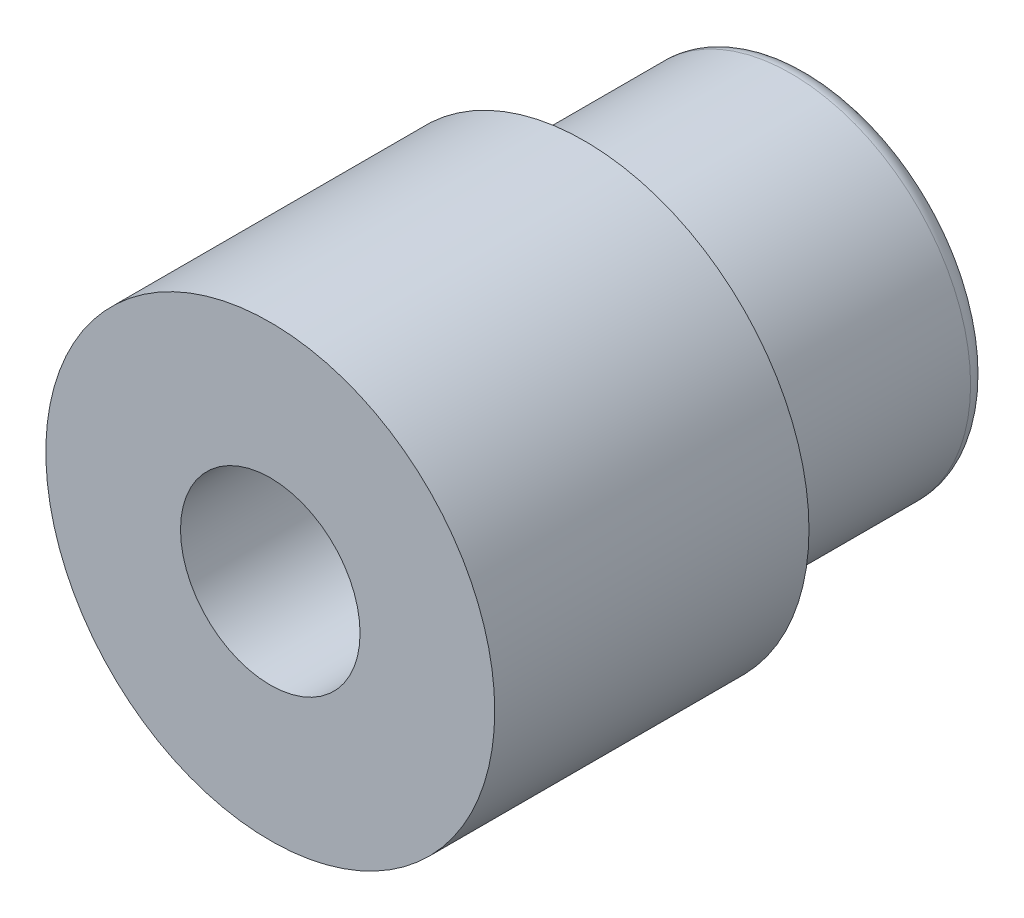
ISO-10303-21;
HEADER;
FILE_DESCRIPTION(('STEP AP214'),'2;1');
FILE_NAME('part.step','',(''),(''),'','','');
FILE_SCHEMA(('AUTOMOTIVE_DESIGN { 1 0 10303 214 1 1 1 1 }'));
ENDSEC;
DATA;
#1=APPLICATION_CONTEXT('core data for automotive mechanical design processes');
#2=APPLICATION_PROTOCOL_DEFINITION('international standard','automotive_design',2000,#1);
#3=PRODUCT_CONTEXT('',#1,'mechanical');
#4=PRODUCT('Part','Part','',(#3));
#5=PRODUCT_RELATED_PRODUCT_CATEGORY('part','',(#4));
#6=PRODUCT_DEFINITION_FORMATION('','',#4);
#7=PRODUCT_DEFINITION_CONTEXT('part definition',#1,'design');
#8=PRODUCT_DEFINITION('design','',#6,#7);
#9=PRODUCT_DEFINITION_SHAPE('','',#8);
#10=(LENGTH_UNIT() NAMED_UNIT(*) SI_UNIT(.MILLI.,.METRE.));
#11=(NAMED_UNIT(*) PLANE_ANGLE_UNIT() SI_UNIT($,.RADIAN.));
#12=(NAMED_UNIT(*) SI_UNIT($,.STERADIAN.) SOLID_ANGLE_UNIT());
#13=UNCERTAINTY_MEASURE_WITH_UNIT(LENGTH_MEASURE(1.E-05),#10,'distance_accuracy_value','');
#14=(GEOMETRIC_REPRESENTATION_CONTEXT(3) GLOBAL_UNCERTAINTY_ASSIGNED_CONTEXT((#13)) GLOBAL_UNIT_ASSIGNED_CONTEXT((#10,
#11,#12)) REPRESENTATION_CONTEXT('',''));
#15=CARTESIAN_POINT('',(0.,0.,0.));
#16=DIRECTION('',(0.,0.,1.));
#17=DIRECTION('',(1.,0.,0.));
#18=AXIS2_PLACEMENT_3D('',#15,#16,#17);
#19=CARTESIAN_POINT('',(0.,0.,0.));
#20=DIRECTION('',(0.,0.,1.));
#21=DIRECTION('',(1.,0.,0.));
#22=AXIS2_PLACEMENT_3D('',#19,#20,#21);
#23=CYLINDRICAL_SURFACE('',#22,2.5);
#24=CARTESIAN_POINT('',(0.,0.,0.));
#25=DIRECTION('',(0.,0.,1.));
#26=DIRECTION('',(1.,0.,0.));
#27=AXIS2_PLACEMENT_3D('',#24,#25,#26);
#28=CIRCLE('',#27,2.5);
#29=CARTESIAN_POINT('',(2.5,0.,0.));
#30=VERTEX_POINT('',#29);
#31=EDGE_CURVE('E47',#30,#30,#28,.T.);
#32=ORIENTED_EDGE('',*,*,#31,.F.);
#33=EDGE_LOOP('',(#32));
#34=FACE_BOUND('',#33,.T.);
#35=CARTESIAN_POINT('',(0.,0.,-3.5));
#36=DIRECTION('',(0.,0.,1.));
#37=DIRECTION('',(1.,0.,0.));
#38=AXIS2_PLACEMENT_3D('',#35,#36,#37);
#39=CIRCLE('',#38,2.5);
#40=CARTESIAN_POINT('',(2.5,0.,-3.5));
#41=VERTEX_POINT('',#40);
#42=EDGE_CURVE('E58',#41,#41,#39,.T.);
#43=ORIENTED_EDGE('',*,*,#42,.T.);
#44=EDGE_LOOP('',(#43));
#45=FACE_BOUND('',#44,.T.);
#46=ADVANCED_FACE('F32',(#34,#45),#23,.T.);
#47=CARTESIAN_POINT('',(0.,2.5,0.));
#48=DIRECTION('',(0.,0.,-1.));
#49=DIRECTION('',(-1.,0.,0.));
#50=AXIS2_PLACEMENT_3D('',#47,#48,#49);
#51=PLANE('',#50);
#52=CARTESIAN_POINT('',(0.,0.,0.));
#53=DIRECTION('',(0.,0.,1.));
#54=DIRECTION('',(1.,0.,0.));
#55=AXIS2_PLACEMENT_3D('',#52,#53,#54);
#56=CIRCLE('',#55,1.);
#57=CARTESIAN_POINT('',(1.,0.,0.));
#58=VERTEX_POINT('',#57);
#59=EDGE_CURVE('E52',#58,#58,#56,.T.);
#60=ORIENTED_EDGE('',*,*,#59,.F.);
#61=EDGE_LOOP('',(#60));
#62=FACE_BOUND('',#61,.T.);
#63=ORIENTED_EDGE('',*,*,#31,.T.);
#64=EDGE_LOOP('',(#63));
#65=FACE_BOUND('',#64,.T.);
#66=ADVANCED_FACE('F77',(#62,#65),#51,.F.);
#67=CARTESIAN_POINT('',(0.,0.,0.));
#68=DIRECTION('',(0.,0.,1.));
#69=DIRECTION('',(1.,0.,0.));
#70=AXIS2_PLACEMENT_3D('',#67,#68,#69);
#71=CYLINDRICAL_SURFACE('',#70,1.);
#72=CARTESIAN_POINT('',(0.,0.,-5.2));
#73=DIRECTION('',(0.,0.,1.));
#74=DIRECTION('',(1.,0.,0.));
#75=AXIS2_PLACEMENT_3D('',#72,#73,#74);
#76=CIRCLE('',#75,1.);
#77=CARTESIAN_POINT('',(1.,0.,-5.2));
#78=VERTEX_POINT('',#77);
#79=EDGE_CURVE('E39',#78,#78,#76,.F.);
#80=ORIENTED_EDGE('',*,*,#79,.T.);
#81=EDGE_LOOP('',(#80));
#82=FACE_BOUND('',#81,.T.);
#83=ORIENTED_EDGE('',*,*,#59,.T.);
#84=EDGE_LOOP('',(#83));
#85=FACE_BOUND('',#84,.T.);
#86=ADVANCED_FACE('F72',(#82,#85),#71,.F.);
#87=CARTESIAN_POINT('',(0.,0.,0.));
#88=DIRECTION('',(0.,0.,1.));
#89=DIRECTION('',(1.,0.,0.));
#90=AXIS2_PLACEMENT_3D('',#87,#88,#89);
#91=CYLINDRICAL_SURFACE('',#90,2.);
#92=CARTESIAN_POINT('',(0.,0.,-5.8));
#93=DIRECTION('',(0.,0.,1.));
#94=DIRECTION('',(1.,0.,0.));
#95=AXIS2_PLACEMENT_3D('',#92,#93,#94);
#96=CIRCLE('',#95,2.);
#97=CARTESIAN_POINT('',(2.,0.,-5.8));
#98=VERTEX_POINT('',#97);
#99=EDGE_CURVE('E10',#98,#98,#96,.T.);
#100=ORIENTED_EDGE('',*,*,#99,.T.);
#101=EDGE_LOOP('',(#100));
#102=FACE_BOUND('',#101,.T.);
#103=CARTESIAN_POINT('',(0.,0.,-3.5));
#104=DIRECTION('',(0.,0.,1.));
#105=DIRECTION('',(1.,0.,0.));
#106=AXIS2_PLACEMENT_3D('',#103,#104,#105);
#107=CIRCLE('',#106,2.);
#108=CARTESIAN_POINT('',(2.,0.,-3.5));
#109=VERTEX_POINT('',#108);
#110=EDGE_CURVE('E55',#109,#109,#107,.T.);
#111=ORIENTED_EDGE('',*,*,#110,.F.);
#112=EDGE_LOOP('',(#111));
#113=FACE_BOUND('',#112,.T.);
#114=ADVANCED_FACE('F67',(#102,#113),#91,.T.);
#115=CARTESIAN_POINT('',(0.,2.,-3.5));
#116=DIRECTION('',(0.,0.,1.));
#117=DIRECTION('',(1.,0.,0.));
#118=AXIS2_PLACEMENT_3D('',#115,#116,#117);
#119=PLANE('',#118);
#120=ORIENTED_EDGE('',*,*,#42,.F.);
#121=EDGE_LOOP('',(#120));
#122=FACE_BOUND('',#121,.T.);
#123=ORIENTED_EDGE('',*,*,#110,.T.);
#124=EDGE_LOOP('',(#123));
#125=FACE_BOUND('',#124,.T.);
#126=ADVANCED_FACE('F63',(#122,#125),#119,.F.);
#127=CARTESIAN_POINT('',(0.,0.,-5.2));
#128=DIRECTION('',(0.,0.,1.));
#129=DIRECTION('',(1.,0.,0.));
#130=AXIS2_PLACEMENT_3D('',#127,#128,#129);
#131=TOROIDAL_SURFACE('',#130,1.8,0.8);
#132=ORIENTED_EDGE('',*,*,#79,.F.);
#133=EDGE_LOOP('',(#132));
#134=FACE_BOUND('',#133,.T.);
#135=CARTESIAN_POINT('',(0.,0.,-6.));
#136=DIRECTION('',(0.,0.,1.));
#137=DIRECTION('',(1.,0.,0.));
#138=AXIS2_PLACEMENT_3D('',#135,#136,#137);
#139=CIRCLE('',#138,1.8);
#140=CARTESIAN_POINT('',(1.8,0.,-6.));
#141=VERTEX_POINT('',#140);
#142=EDGE_CURVE('E43',#141,#141,#139,.T.);
#143=ORIENTED_EDGE('',*,*,#142,.F.);
#144=EDGE_LOOP('',(#143));
#145=FACE_BOUND('',#144,.T.);
#146=ADVANCED_FACE('F66',(#134,#145),#131,.T.);
#147=CARTESIAN_POINT('',(0.,0.,-5.8));
#148=DIRECTION('',(0.,0.,1.));
#149=DIRECTION('',(1.,0.,0.));
#150=AXIS2_PLACEMENT_3D('',#147,#148,#149);
#151=TOROIDAL_SURFACE('',#150,1.8,0.2);
#152=ORIENTED_EDGE('',*,*,#142,.T.);
#153=EDGE_LOOP('',(#152));
#154=FACE_BOUND('',#153,.T.);
#155=ORIENTED_EDGE('',*,*,#99,.F.);
#156=EDGE_LOOP('',(#155));
#157=FACE_BOUND('',#156,.T.);
#158=ADVANCED_FACE('F34',(#154,#157),#151,.T.);
#159=CLOSED_SHELL('',(#46,#66,#86,#114,#126,#146,#158));
#160=MANIFOLD_SOLID_BREP('B2',#159);
#161=ADVANCED_BREP_SHAPE_REPRESENTATION('',(#18,#160),#14);
#162=SHAPE_DEFINITION_REPRESENTATION(#9,#161);
ENDSEC;
END-ISO-10303-21;
